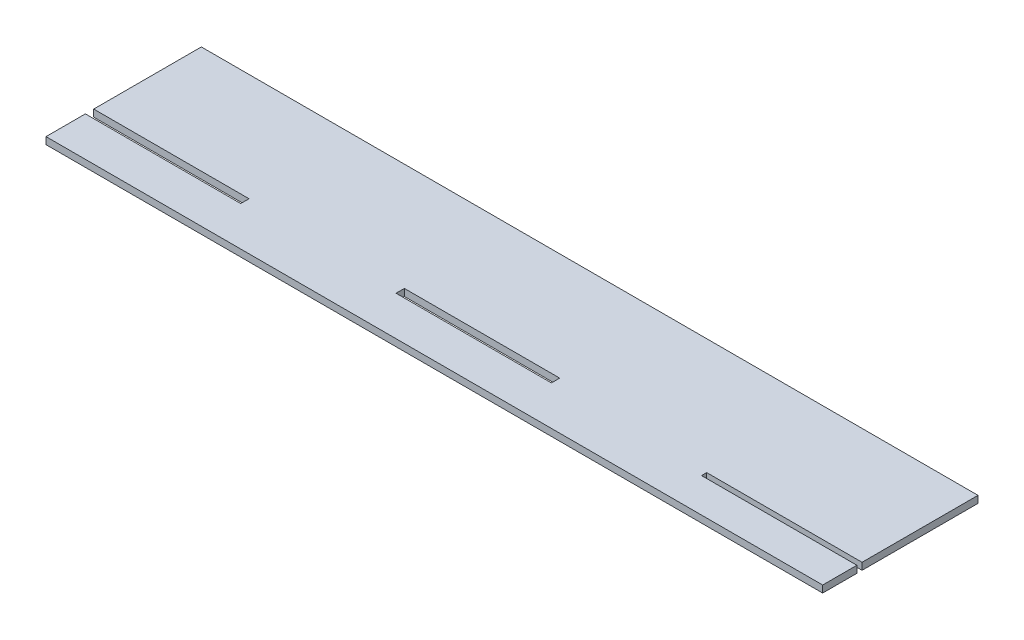
ISO-10303-21;
HEADER;
FILE_DESCRIPTION(('STEP AP214'),'2;1');
FILE_NAME('part.step','',(''),(''),'','','');
FILE_SCHEMA(('AUTOMOTIVE_DESIGN { 1 0 10303 214 1 1 1 1 }'));
ENDSEC;
DATA;
#1=APPLICATION_CONTEXT('core data for automotive mechanical design processes');
#2=APPLICATION_PROTOCOL_DEFINITION('international standard','automotive_design',2000,#1);
#3=PRODUCT_CONTEXT('',#1,'mechanical');
#4=PRODUCT('Part','Part','',(#3));
#5=PRODUCT_RELATED_PRODUCT_CATEGORY('part','',(#4));
#6=PRODUCT_DEFINITION_FORMATION('','',#4);
#7=PRODUCT_DEFINITION_CONTEXT('part definition',#1,'design');
#8=PRODUCT_DEFINITION('design','',#6,#7);
#9=PRODUCT_DEFINITION_SHAPE('','',#8);
#10=(LENGTH_UNIT() NAMED_UNIT(*) SI_UNIT(.MILLI.,.METRE.));
#11=(NAMED_UNIT(*) PLANE_ANGLE_UNIT() SI_UNIT($,.RADIAN.));
#12=(NAMED_UNIT(*) SI_UNIT($,.STERADIAN.) SOLID_ANGLE_UNIT());
#13=UNCERTAINTY_MEASURE_WITH_UNIT(LENGTH_MEASURE(1.E-05),#10,'distance_accuracy_value','');
#14=(GEOMETRIC_REPRESENTATION_CONTEXT(3) GLOBAL_UNCERTAINTY_ASSIGNED_CONTEXT((#13)) GLOBAL_UNIT_ASSIGNED_CONTEXT((#10,
#11,#12)) REPRESENTATION_CONTEXT('',''));
#15=CARTESIAN_POINT('',(0.,0.,0.));
#16=DIRECTION('',(0.,0.,1.));
#17=DIRECTION('',(1.,0.,0.));
#18=AXIS2_PLACEMENT_3D('',#15,#16,#17);
#19=CARTESIAN_POINT('',(0.,2.7,0.));
#20=DIRECTION('',(0.,1.,0.));
#21=DIRECTION('',(0.,0.,1.));
#22=AXIS2_PLACEMENT_3D('',#19,#20,#21);
#23=PLANE('',#22);
#24=DIRECTION('',(0.,0.,-1.));
#25=VECTOR('',#24,1.);
#26=CARTESIAN_POINT('',(150.,2.7,16.782));
#27=LINE('',#26,#25);
#28=CARTESIAN_POINT('',(150.,2.7,30.));
#29=VERTEX_POINT('',#28);
#30=CARTESIAN_POINT('',(150.,2.7,16.782));
#31=VERTEX_POINT('',#30);
#32=EDGE_CURVE('E184',#29,#31,#27,.T.);
#33=ORIENTED_EDGE('',*,*,#32,.T.);
#34=DIRECTION('',(-1.,0.,0.));
#35=VECTOR('',#34,1.);
#36=CARTESIAN_POINT('',(90.,2.7,16.782));
#37=LINE('',#36,#35);
#38=CARTESIAN_POINT('',(90.,2.7,16.782));
#39=VERTEX_POINT('',#38);
#40=EDGE_CURVE('E187',#31,#39,#37,.T.);
#41=ORIENTED_EDGE('',*,*,#40,.T.);
#42=DIRECTION('',(0.,0.,-1.));
#43=VECTOR('',#42,1.);
#44=CARTESIAN_POINT('',(90.,2.7,16.782));
#45=LINE('',#44,#43);
#46=CARTESIAN_POINT('',(90.,2.7,14.79));
#47=VERTEX_POINT('',#46);
#48=EDGE_CURVE('E190',#39,#47,#45,.T.);
#49=ORIENTED_EDGE('',*,*,#48,.T.);
#50=DIRECTION('',(1.,0.,0.));
#51=VECTOR('',#50,1.);
#52=CARTESIAN_POINT('',(90.,2.7,14.79));
#53=LINE('',#52,#51);
#54=CARTESIAN_POINT('',(150.,2.7,14.79));
#55=VERTEX_POINT('',#54);
#56=EDGE_CURVE('E192',#47,#55,#53,.T.);
#57=ORIENTED_EDGE('',*,*,#56,.T.);
#58=DIRECTION('',(0.,0.,-1.));
#59=VECTOR('',#58,1.);
#60=CARTESIAN_POINT('',(150.,2.7,-30.));
#61=LINE('',#60,#59);
#62=CARTESIAN_POINT('',(150.,2.7,-30.));
#63=VERTEX_POINT('',#62);
#64=EDGE_CURVE('E194',#55,#63,#61,.T.);
#65=ORIENTED_EDGE('',*,*,#64,.T.);
#66=DIRECTION('',(-1.,0.,0.));
#67=VECTOR('',#66,1.);
#68=CARTESIAN_POINT('',(-150.,2.7,-30.));
#69=LINE('',#68,#67);
#70=CARTESIAN_POINT('',(-150.,2.7,-30.));
#71=VERTEX_POINT('',#70);
#72=EDGE_CURVE('E196',#63,#71,#69,.T.);
#73=ORIENTED_EDGE('',*,*,#72,.T.);
#74=DIRECTION('',(0.,0.,1.));
#75=VECTOR('',#74,1.);
#76=CARTESIAN_POINT('',(-150.,2.7,-30.));
#77=LINE('',#76,#75);
#78=CARTESIAN_POINT('',(-150.,2.7,11.572));
#79=VERTEX_POINT('',#78);
#80=EDGE_CURVE('E198',#71,#79,#77,.T.);
#81=ORIENTED_EDGE('',*,*,#80,.T.);
#82=DIRECTION('',(1.,0.,0.));
#83=VECTOR('',#82,1.);
#84=CARTESIAN_POINT('',(-150.,2.7,11.572));
#85=LINE('',#84,#83);
#86=CARTESIAN_POINT('',(-90.,2.7,11.572));
#87=VERTEX_POINT('',#86);
#88=EDGE_CURVE('E200',#79,#87,#85,.T.);
#89=ORIENTED_EDGE('',*,*,#88,.T.);
#90=DIRECTION('',(0.,0.,1.));
#91=VECTOR('',#90,1.);
#92=CARTESIAN_POINT('',(-90.,2.7,11.572));
#93=LINE('',#92,#91);
#94=CARTESIAN_POINT('',(-90.,2.7,14.79));
#95=VERTEX_POINT('',#94);
#96=EDGE_CURVE('E202',#87,#95,#93,.T.);
#97=ORIENTED_EDGE('',*,*,#96,.T.);
#98=DIRECTION('',(-1.,0.,0.));
#99=VECTOR('',#98,1.);
#100=CARTESIAN_POINT('',(-150.,2.7,14.79));
#101=LINE('',#100,#99);
#102=CARTESIAN_POINT('',(-150.,2.7,14.79));
#103=VERTEX_POINT('',#102);
#104=EDGE_CURVE('E204',#95,#103,#101,.T.);
#105=ORIENTED_EDGE('',*,*,#104,.T.);
#106=DIRECTION('',(0.,0.,1.));
#107=VECTOR('',#106,1.);
#108=CARTESIAN_POINT('',(-150.,2.7,14.79));
#109=LINE('',#108,#107);
#110=CARTESIAN_POINT('',(-150.,2.7,30.));
#111=VERTEX_POINT('',#110);
#112=EDGE_CURVE('E206',#103,#111,#109,.T.);
#113=ORIENTED_EDGE('',*,*,#112,.T.);
#114=DIRECTION('',(1.,0.,0.));
#115=VECTOR('',#114,1.);
#116=CARTESIAN_POINT('',(-150.,2.7,30.));
#117=LINE('',#116,#115);
#118=EDGE_CURVE('E208',#111,#29,#117,.T.);
#119=ORIENTED_EDGE('',*,*,#118,.T.);
#120=EDGE_LOOP('',(#33,#41,#49,#57,#65,#73,#81,#89,#97,#105,#113,#119));
#121=FACE_BOUND('',#120,.T.);
#122=DIRECTION('',(0.,0.,-1.));
#123=VECTOR('',#122,1.);
#124=CARTESIAN_POINT('',(30.,2.7,11.572));
#125=LINE('',#124,#123);
#126=CARTESIAN_POINT('',(30.,2.7,14.79));
#127=VERTEX_POINT('',#126);
#128=CARTESIAN_POINT('',(30.,2.7,11.572));
#129=VERTEX_POINT('',#128);
#130=EDGE_CURVE('E156',#127,#129,#125,.T.);
#131=ORIENTED_EDGE('',*,*,#130,.F.);
#132=DIRECTION('',(1.,0.,0.));
#133=VECTOR('',#132,1.);
#134=CARTESIAN_POINT('',(-30.,2.7,14.79));
#135=LINE('',#134,#133);
#136=CARTESIAN_POINT('',(-30.,2.7,14.79));
#137=VERTEX_POINT('',#136);
#138=EDGE_CURVE('E148',#137,#127,#135,.T.);
#139=ORIENTED_EDGE('',*,*,#138,.F.);
#140=DIRECTION('',(0.,0.,1.));
#141=VECTOR('',#140,1.);
#142=CARTESIAN_POINT('',(-30.,2.7,11.572));
#143=LINE('',#142,#141);
#144=CARTESIAN_POINT('',(-30.,2.7,11.572));
#145=VERTEX_POINT('',#144);
#146=EDGE_CURVE('E170',#145,#137,#143,.T.);
#147=ORIENTED_EDGE('',*,*,#146,.F.);
#148=DIRECTION('',(-1.,0.,0.));
#149=VECTOR('',#148,1.);
#150=CARTESIAN_POINT('',(-30.,2.7,11.572));
#151=LINE('',#150,#149);
#152=EDGE_CURVE('E168',#129,#145,#151,.T.);
#153=ORIENTED_EDGE('',*,*,#152,.F.);
#154=EDGE_LOOP('',(#131,#139,#147,#153));
#155=FACE_BOUND('',#154,.T.);
#156=ADVANCED_FACE('F35',(#121,#155),#23,.T.);
#157=CARTESIAN_POINT('',(0.,0.,0.));
#158=DIRECTION('',(0.,1.,0.));
#159=DIRECTION('',(0.,0.,1.));
#160=AXIS2_PLACEMENT_3D('',#157,#158,#159);
#161=PLANE('',#160);
#162=DIRECTION('',(0.,0.,-1.));
#163=VECTOR('',#162,1.);
#164=CARTESIAN_POINT('',(150.,0.,16.782));
#165=LINE('',#164,#163);
#166=CARTESIAN_POINT('',(150.,0.,30.));
#167=VERTEX_POINT('',#166);
#168=CARTESIAN_POINT('',(150.,0.,16.782));
#169=VERTEX_POINT('',#168);
#170=EDGE_CURVE('E164',#167,#169,#165,.T.);
#171=ORIENTED_EDGE('',*,*,#170,.F.);
#172=DIRECTION('',(1.,0.,0.));
#173=VECTOR('',#172,1.);
#174=CARTESIAN_POINT('',(-150.,0.,30.));
#175=LINE('',#174,#173);
#176=CARTESIAN_POINT('',(-150.,0.,30.));
#177=VERTEX_POINT('',#176);
#178=EDGE_CURVE('E188',#177,#167,#175,.T.);
#179=ORIENTED_EDGE('',*,*,#178,.F.);
#180=DIRECTION('',(0.,0.,1.));
#181=VECTOR('',#180,1.);
#182=CARTESIAN_POINT('',(-150.,0.,14.79));
#183=LINE('',#182,#181);
#184=CARTESIAN_POINT('',(-150.,0.,14.79));
#185=VERTEX_POINT('',#184);
#186=EDGE_CURVE('E231',#185,#177,#183,.T.);
#187=ORIENTED_EDGE('',*,*,#186,.F.);
#188=DIRECTION('',(-1.,0.,0.));
#189=VECTOR('',#188,1.);
#190=CARTESIAN_POINT('',(-150.,0.,14.79));
#191=LINE('',#190,#189);
#192=CARTESIAN_POINT('',(-90.,0.,14.79));
#193=VERTEX_POINT('',#192);
#194=EDGE_CURVE('E229',#193,#185,#191,.T.);
#195=ORIENTED_EDGE('',*,*,#194,.F.);
#196=DIRECTION('',(0.,0.,1.));
#197=VECTOR('',#196,1.);
#198=CARTESIAN_POINT('',(-90.,0.,11.572));
#199=LINE('',#198,#197);
#200=CARTESIAN_POINT('',(-90.,0.,11.572));
#201=VERTEX_POINT('',#200);
#202=EDGE_CURVE('E227',#201,#193,#199,.T.);
#203=ORIENTED_EDGE('',*,*,#202,.F.);
#204=DIRECTION('',(1.,0.,0.));
#205=VECTOR('',#204,1.);
#206=CARTESIAN_POINT('',(-150.,0.,11.572));
#207=LINE('',#206,#205);
#208=CARTESIAN_POINT('',(-150.,0.,11.572));
#209=VERTEX_POINT('',#208);
#210=EDGE_CURVE('E225',#209,#201,#207,.T.);
#211=ORIENTED_EDGE('',*,*,#210,.F.);
#212=DIRECTION('',(0.,0.,1.));
#213=VECTOR('',#212,1.);
#214=CARTESIAN_POINT('',(-150.,0.,-30.));
#215=LINE('',#214,#213);
#216=CARTESIAN_POINT('',(-150.,0.,-30.));
#217=VERTEX_POINT('',#216);
#218=EDGE_CURVE('E223',#217,#209,#215,.T.);
#219=ORIENTED_EDGE('',*,*,#218,.F.);
#220=DIRECTION('',(-1.,0.,0.));
#221=VECTOR('',#220,1.);
#222=CARTESIAN_POINT('',(-150.,0.,-30.));
#223=LINE('',#222,#221);
#224=CARTESIAN_POINT('',(150.,0.,-30.));
#225=VERTEX_POINT('',#224);
#226=EDGE_CURVE('E221',#225,#217,#223,.T.);
#227=ORIENTED_EDGE('',*,*,#226,.F.);
#228=DIRECTION('',(0.,0.,-1.));
#229=VECTOR('',#228,1.);
#230=CARTESIAN_POINT('',(150.,0.,-30.));
#231=LINE('',#230,#229);
#232=CARTESIAN_POINT('',(150.,0.,14.79));
#233=VERTEX_POINT('',#232);
#234=EDGE_CURVE('E219',#233,#225,#231,.T.);
#235=ORIENTED_EDGE('',*,*,#234,.F.);
#236=DIRECTION('',(1.,0.,0.));
#237=VECTOR('',#236,1.);
#238=CARTESIAN_POINT('',(90.,0.,14.79));
#239=LINE('',#238,#237);
#240=CARTESIAN_POINT('',(90.,0.,14.79));
#241=VERTEX_POINT('',#240);
#242=EDGE_CURVE('E217',#241,#233,#239,.T.);
#243=ORIENTED_EDGE('',*,*,#242,.F.);
#244=DIRECTION('',(0.,0.,-1.));
#245=VECTOR('',#244,1.);
#246=CARTESIAN_POINT('',(90.,0.,16.782));
#247=LINE('',#246,#245);
#248=CARTESIAN_POINT('',(90.,0.,16.782));
#249=VERTEX_POINT('',#248);
#250=EDGE_CURVE('E215',#249,#241,#247,.T.);
#251=ORIENTED_EDGE('',*,*,#250,.F.);
#252=DIRECTION('',(-1.,0.,0.));
#253=VECTOR('',#252,1.);
#254=CARTESIAN_POINT('',(90.,0.,16.782));
#255=LINE('',#254,#253);
#256=EDGE_CURVE('E213',#169,#249,#255,.T.);
#257=ORIENTED_EDGE('',*,*,#256,.F.);
#258=EDGE_LOOP('',(#171,#179,#187,#195,#203,#211,#219,#227,#235,#243,#251,#257));
#259=FACE_BOUND('',#258,.T.);
#260=DIRECTION('',(1.,0.,0.));
#261=VECTOR('',#260,1.);
#262=CARTESIAN_POINT('',(-30.,0.,14.79));
#263=LINE('',#262,#261);
#264=CARTESIAN_POINT('',(-30.,0.,14.79));
#265=VERTEX_POINT('',#264);
#266=CARTESIAN_POINT('',(30.,0.,14.79));
#267=VERTEX_POINT('',#266);
#268=EDGE_CURVE('E58',#265,#267,#263,.T.);
#269=ORIENTED_EDGE('',*,*,#268,.T.);
#270=DIRECTION('',(0.,0.,-1.));
#271=VECTOR('',#270,1.);
#272=CARTESIAN_POINT('',(30.,0.,11.572));
#273=LINE('',#272,#271);
#274=CARTESIAN_POINT('',(30.,0.,11.572));
#275=VERTEX_POINT('',#274);
#276=EDGE_CURVE('E163',#267,#275,#273,.T.);
#277=ORIENTED_EDGE('',*,*,#276,.T.);
#278=DIRECTION('',(-1.,0.,0.));
#279=VECTOR('',#278,1.);
#280=CARTESIAN_POINT('',(-30.,0.,11.572));
#281=LINE('',#280,#279);
#282=CARTESIAN_POINT('',(-30.,0.,11.572));
#283=VERTEX_POINT('',#282);
#284=EDGE_CURVE('E176',#275,#283,#281,.T.);
#285=ORIENTED_EDGE('',*,*,#284,.T.);
#286=DIRECTION('',(0.,0.,1.));
#287=VECTOR('',#286,1.);
#288=CARTESIAN_POINT('',(-30.,0.,11.572));
#289=LINE('',#288,#287);
#290=EDGE_CURVE('E157',#283,#265,#289,.T.);
#291=ORIENTED_EDGE('',*,*,#290,.T.);
#292=EDGE_LOOP('',(#269,#277,#285,#291));
#293=FACE_BOUND('',#292,.T.);
#294=ADVANCED_FACE('F273',(#259,#293),#161,.F.);
#295=CARTESIAN_POINT('',(150.,2.7,16.782));
#296=DIRECTION('',(-1.,0.,0.));
#297=DIRECTION('',(0.,0.,1.));
#298=AXIS2_PLACEMENT_3D('',#295,#296,#297);
#299=PLANE('',#298);
#300=ORIENTED_EDGE('',*,*,#170,.T.);
#301=DIRECTION('',(0.,-1.,0.));
#302=VECTOR('',#301,1.);
#303=CARTESIAN_POINT('',(150.,2.7,16.782));
#304=LINE('',#303,#302);
#305=EDGE_CURVE('E11',#31,#169,#304,.T.);
#306=ORIENTED_EDGE('',*,*,#305,.F.);
#307=ORIENTED_EDGE('',*,*,#32,.F.);
#308=DIRECTION('',(0.,-1.,0.));
#309=VECTOR('',#308,1.);
#310=CARTESIAN_POINT('',(150.,2.7,30.));
#311=LINE('',#310,#309);
#312=EDGE_CURVE('E210',#29,#167,#311,.T.);
#313=ORIENTED_EDGE('',*,*,#312,.T.);
#314=EDGE_LOOP('',(#300,#306,#307,#313));
#315=FACE_BOUND('',#314,.T.);
#316=ADVANCED_FACE('F37',(#315),#299,.F.);
#317=CARTESIAN_POINT('',(90.,2.7,16.782));
#318=DIRECTION('',(0.,0.,1.));
#319=DIRECTION('',(1.,0.,0.));
#320=AXIS2_PLACEMENT_3D('',#317,#318,#319);
#321=PLANE('',#320);
#322=ORIENTED_EDGE('',*,*,#256,.T.);
#323=DIRECTION('',(0.,-1.,0.));
#324=VECTOR('',#323,1.);
#325=CARTESIAN_POINT('',(90.,2.7,16.782));
#326=LINE('',#325,#324);
#327=EDGE_CURVE('E43',#39,#249,#326,.T.);
#328=ORIENTED_EDGE('',*,*,#327,.F.);
#329=ORIENTED_EDGE('',*,*,#40,.F.);
#330=ORIENTED_EDGE('',*,*,#305,.T.);
#331=EDGE_LOOP('',(#322,#328,#329,#330));
#332=FACE_BOUND('',#331,.T.);
#333=ADVANCED_FACE('F290',(#332),#321,.F.);
#334=CARTESIAN_POINT('',(90.,2.7,16.782));
#335=DIRECTION('',(-1.,0.,0.));
#336=DIRECTION('',(0.,0.,1.));
#337=AXIS2_PLACEMENT_3D('',#334,#335,#336);
#338=PLANE('',#337);
#339=ORIENTED_EDGE('',*,*,#250,.T.);
#340=DIRECTION('',(0.,-1.,0.));
#341=VECTOR('',#340,1.);
#342=CARTESIAN_POINT('',(90.,2.7,14.79));
#343=LINE('',#342,#341);
#344=EDGE_CURVE('E260',#47,#241,#343,.T.);
#345=ORIENTED_EDGE('',*,*,#344,.F.);
#346=ORIENTED_EDGE('',*,*,#48,.F.);
#347=ORIENTED_EDGE('',*,*,#327,.T.);
#348=EDGE_LOOP('',(#339,#345,#346,#347));
#349=FACE_BOUND('',#348,.T.);
#350=ADVANCED_FACE('F267',(#349),#338,.F.);
#351=CARTESIAN_POINT('',(90.,2.7,14.79));
#352=DIRECTION('',(0.,0.,-1.));
#353=DIRECTION('',(-1.,0.,0.));
#354=AXIS2_PLACEMENT_3D('',#351,#352,#353);
#355=PLANE('',#354);
#356=ORIENTED_EDGE('',*,*,#242,.T.);
#357=DIRECTION('',(0.,-1.,0.));
#358=VECTOR('',#357,1.);
#359=CARTESIAN_POINT('',(150.,2.7,14.79));
#360=LINE('',#359,#358);
#361=EDGE_CURVE('E257',#55,#233,#360,.T.);
#362=ORIENTED_EDGE('',*,*,#361,.F.);
#363=ORIENTED_EDGE('',*,*,#56,.F.);
#364=ORIENTED_EDGE('',*,*,#344,.T.);
#365=EDGE_LOOP('',(#356,#362,#363,#364));
#366=FACE_BOUND('',#365,.T.);
#367=ADVANCED_FACE('F279',(#366),#355,.F.);
#368=CARTESIAN_POINT('',(150.,2.7,-30.));
#369=DIRECTION('',(-1.,0.,0.));
#370=DIRECTION('',(0.,0.,1.));
#371=AXIS2_PLACEMENT_3D('',#368,#369,#370);
#372=PLANE('',#371);
#373=ORIENTED_EDGE('',*,*,#234,.T.);
#374=DIRECTION('',(0.,-1.,0.));
#375=VECTOR('',#374,1.);
#376=CARTESIAN_POINT('',(150.,2.7,-30.));
#377=LINE('',#376,#375);
#378=EDGE_CURVE('E254',#63,#225,#377,.T.);
#379=ORIENTED_EDGE('',*,*,#378,.F.);
#380=ORIENTED_EDGE('',*,*,#64,.F.);
#381=ORIENTED_EDGE('',*,*,#361,.T.);
#382=EDGE_LOOP('',(#373,#379,#380,#381));
#383=FACE_BOUND('',#382,.T.);
#384=ADVANCED_FACE('F283',(#383),#372,.F.);
#385=CARTESIAN_POINT('',(-150.,2.7,-30.));
#386=DIRECTION('',(0.,0.,1.));
#387=DIRECTION('',(1.,0.,0.));
#388=AXIS2_PLACEMENT_3D('',#385,#386,#387);
#389=PLANE('',#388);
#390=ORIENTED_EDGE('',*,*,#226,.T.);
#391=DIRECTION('',(0.,-1.,0.));
#392=VECTOR('',#391,1.);
#393=CARTESIAN_POINT('',(-150.,2.7,-30.));
#394=LINE('',#393,#392);
#395=EDGE_CURVE('E251',#71,#217,#394,.T.);
#396=ORIENTED_EDGE('',*,*,#395,.F.);
#397=ORIENTED_EDGE('',*,*,#72,.F.);
#398=ORIENTED_EDGE('',*,*,#378,.T.);
#399=EDGE_LOOP('',(#390,#396,#397,#398));
#400=FACE_BOUND('',#399,.T.);
#401=ADVANCED_FACE('F323',(#400),#389,.F.);
#402=CARTESIAN_POINT('',(-150.,2.7,-30.));
#403=DIRECTION('',(1.,0.,0.));
#404=DIRECTION('',(0.,0.,-1.));
#405=AXIS2_PLACEMENT_3D('',#402,#403,#404);
#406=PLANE('',#405);
#407=ORIENTED_EDGE('',*,*,#218,.T.);
#408=DIRECTION('',(0.,-1.,0.));
#409=VECTOR('',#408,1.);
#410=CARTESIAN_POINT('',(-150.,2.7,11.572));
#411=LINE('',#410,#409);
#412=EDGE_CURVE('E248',#79,#209,#411,.T.);
#413=ORIENTED_EDGE('',*,*,#412,.F.);
#414=ORIENTED_EDGE('',*,*,#80,.F.);
#415=ORIENTED_EDGE('',*,*,#395,.T.);
#416=EDGE_LOOP('',(#407,#413,#414,#415));
#417=FACE_BOUND('',#416,.T.);
#418=ADVANCED_FACE('F321',(#417),#406,.F.);
#419=CARTESIAN_POINT('',(-150.,2.7,11.572));
#420=DIRECTION('',(0.,0.,-1.));
#421=DIRECTION('',(-1.,0.,0.));
#422=AXIS2_PLACEMENT_3D('',#419,#420,#421);
#423=PLANE('',#422);
#424=ORIENTED_EDGE('',*,*,#210,.T.);
#425=DIRECTION('',(0.,-1.,0.));
#426=VECTOR('',#425,1.);
#427=CARTESIAN_POINT('',(-90.,2.7,11.572));
#428=LINE('',#427,#426);
#429=EDGE_CURVE('E245',#87,#201,#428,.T.);
#430=ORIENTED_EDGE('',*,*,#429,.F.);
#431=ORIENTED_EDGE('',*,*,#88,.F.);
#432=ORIENTED_EDGE('',*,*,#412,.T.);
#433=EDGE_LOOP('',(#424,#430,#431,#432));
#434=FACE_BOUND('',#433,.T.);
#435=ADVANCED_FACE('F317',(#434),#423,.F.);
#436=CARTESIAN_POINT('',(-90.,2.7,11.572));
#437=DIRECTION('',(1.,0.,0.));
#438=DIRECTION('',(0.,0.,-1.));
#439=AXIS2_PLACEMENT_3D('',#436,#437,#438);
#440=PLANE('',#439);
#441=ORIENTED_EDGE('',*,*,#202,.T.);
#442=DIRECTION('',(0.,-1.,0.));
#443=VECTOR('',#442,1.);
#444=CARTESIAN_POINT('',(-90.,2.7,14.79));
#445=LINE('',#444,#443);
#446=EDGE_CURVE('E242',#95,#193,#445,.T.);
#447=ORIENTED_EDGE('',*,*,#446,.F.);
#448=ORIENTED_EDGE('',*,*,#96,.F.);
#449=ORIENTED_EDGE('',*,*,#429,.T.);
#450=EDGE_LOOP('',(#441,#447,#448,#449));
#451=FACE_BOUND('',#450,.T.);
#452=ADVANCED_FACE('F312',(#451),#440,.F.);
#453=CARTESIAN_POINT('',(-150.,2.7,14.79));
#454=DIRECTION('',(0.,0.,1.));
#455=DIRECTION('',(1.,0.,0.));
#456=AXIS2_PLACEMENT_3D('',#453,#454,#455);
#457=PLANE('',#456);
#458=ORIENTED_EDGE('',*,*,#194,.T.);
#459=DIRECTION('',(0.,-1.,0.));
#460=VECTOR('',#459,1.);
#461=CARTESIAN_POINT('',(-150.,2.7,14.79));
#462=LINE('',#461,#460);
#463=EDGE_CURVE('E239',#103,#185,#462,.T.);
#464=ORIENTED_EDGE('',*,*,#463,.F.);
#465=ORIENTED_EDGE('',*,*,#104,.F.);
#466=ORIENTED_EDGE('',*,*,#446,.T.);
#467=EDGE_LOOP('',(#458,#464,#465,#466));
#468=FACE_BOUND('',#467,.T.);
#469=ADVANCED_FACE('F306',(#468),#457,.F.);
#470=CARTESIAN_POINT('',(-150.,2.7,14.79));
#471=DIRECTION('',(1.,0.,0.));
#472=DIRECTION('',(0.,0.,-1.));
#473=AXIS2_PLACEMENT_3D('',#470,#471,#472);
#474=PLANE('',#473);
#475=ORIENTED_EDGE('',*,*,#186,.T.);
#476=DIRECTION('',(0.,-1.,0.));
#477=VECTOR('',#476,1.);
#478=CARTESIAN_POINT('',(-150.,2.7,30.));
#479=LINE('',#478,#477);
#480=EDGE_CURVE('E236',#111,#177,#479,.T.);
#481=ORIENTED_EDGE('',*,*,#480,.F.);
#482=ORIENTED_EDGE('',*,*,#112,.F.);
#483=ORIENTED_EDGE('',*,*,#463,.T.);
#484=EDGE_LOOP('',(#475,#481,#482,#483));
#485=FACE_BOUND('',#484,.T.);
#486=ADVANCED_FACE('F302',(#485),#474,.F.);
#487=CARTESIAN_POINT('',(-150.,2.7,30.));
#488=DIRECTION('',(0.,0.,-1.));
#489=DIRECTION('',(-1.,0.,0.));
#490=AXIS2_PLACEMENT_3D('',#487,#488,#489);
#491=PLANE('',#490);
#492=ORIENTED_EDGE('',*,*,#178,.T.);
#493=ORIENTED_EDGE('',*,*,#312,.F.);
#494=ORIENTED_EDGE('',*,*,#118,.F.);
#495=ORIENTED_EDGE('',*,*,#480,.T.);
#496=EDGE_LOOP('',(#492,#493,#494,#495));
#497=FACE_BOUND('',#496,.T.);
#498=ADVANCED_FACE('F297',(#497),#491,.F.);
#499=CARTESIAN_POINT('',(-30.,2.7,14.79));
#500=DIRECTION('',(0.,0.,-1.));
#501=DIRECTION('',(-1.,0.,0.));
#502=AXIS2_PLACEMENT_3D('',#499,#500,#501);
#503=PLANE('',#502);
#504=ORIENTED_EDGE('',*,*,#268,.F.);
#505=DIRECTION('',(0.,-1.,0.));
#506=VECTOR('',#505,1.);
#507=CARTESIAN_POINT('',(-30.,2.7,14.79));
#508=LINE('',#507,#506);
#509=EDGE_CURVE('E152',#137,#265,#508,.T.);
#510=ORIENTED_EDGE('',*,*,#509,.F.);
#511=ORIENTED_EDGE('',*,*,#138,.T.);
#512=DIRECTION('',(0.,-1.,0.));
#513=VECTOR('',#512,1.);
#514=CARTESIAN_POINT('',(30.,2.7,14.79));
#515=LINE('',#514,#513);
#516=EDGE_CURVE('E151',#127,#267,#515,.T.);
#517=ORIENTED_EDGE('',*,*,#516,.T.);
#518=EDGE_LOOP('',(#504,#510,#511,#517));
#519=FACE_BOUND('',#518,.T.);
#520=ADVANCED_FACE('F150',(#519),#503,.T.);
#521=CARTESIAN_POINT('',(30.,2.7,11.572));
#522=DIRECTION('',(-1.,0.,0.));
#523=DIRECTION('',(0.,0.,1.));
#524=AXIS2_PLACEMENT_3D('',#521,#522,#523);
#525=PLANE('',#524);
#526=ORIENTED_EDGE('',*,*,#276,.F.);
#527=ORIENTED_EDGE('',*,*,#516,.F.);
#528=ORIENTED_EDGE('',*,*,#130,.T.);
#529=DIRECTION('',(0.,-1.,0.));
#530=VECTOR('',#529,1.);
#531=CARTESIAN_POINT('',(30.,2.7,11.572));
#532=LINE('',#531,#530);
#533=EDGE_CURVE('E165',#129,#275,#532,.T.);
#534=ORIENTED_EDGE('',*,*,#533,.T.);
#535=EDGE_LOOP('',(#526,#527,#528,#534));
#536=FACE_BOUND('',#535,.T.);
#537=ADVANCED_FACE('F160',(#536),#525,.T.);
#538=CARTESIAN_POINT('',(-30.,2.7,11.572));
#539=DIRECTION('',(0.,0.,1.));
#540=DIRECTION('',(1.,0.,0.));
#541=AXIS2_PLACEMENT_3D('',#538,#539,#540);
#542=PLANE('',#541);
#543=ORIENTED_EDGE('',*,*,#284,.F.);
#544=ORIENTED_EDGE('',*,*,#533,.F.);
#545=ORIENTED_EDGE('',*,*,#152,.T.);
#546=DIRECTION('',(0.,-1.,0.));
#547=VECTOR('',#546,1.);
#548=CARTESIAN_POINT('',(-30.,2.7,11.572));
#549=LINE('',#548,#547);
#550=EDGE_CURVE('E50',#145,#283,#549,.T.);
#551=ORIENTED_EDGE('',*,*,#550,.T.);
#552=EDGE_LOOP('',(#543,#544,#545,#551));
#553=FACE_BOUND('',#552,.T.);
#554=ADVANCED_FACE('F381',(#553),#542,.T.);
#555=CARTESIAN_POINT('',(-30.,2.7,11.572));
#556=DIRECTION('',(1.,0.,0.));
#557=DIRECTION('',(0.,0.,-1.));
#558=AXIS2_PLACEMENT_3D('',#555,#556,#557);
#559=PLANE('',#558);
#560=ORIENTED_EDGE('',*,*,#290,.F.);
#561=ORIENTED_EDGE('',*,*,#550,.F.);
#562=ORIENTED_EDGE('',*,*,#146,.T.);
#563=ORIENTED_EDGE('',*,*,#509,.T.);
#564=EDGE_LOOP('',(#560,#561,#562,#563));
#565=FACE_BOUND('',#564,.T.);
#566=ADVANCED_FACE('F387',(#565),#559,.T.);
#567=CLOSED_SHELL('',(#156,#294,#316,#333,#350,#367,#384,#401,#418,#435,#452,#469,#486,#498,
#520,#537,#554,#566));
#568=MANIFOLD_SOLID_BREP('B2',#567);
#569=ADVANCED_BREP_SHAPE_REPRESENTATION('',(#18,#568),#14);
#570=SHAPE_DEFINITION_REPRESENTATION(#9,#569);
ENDSEC;
END-ISO-10303-21;
